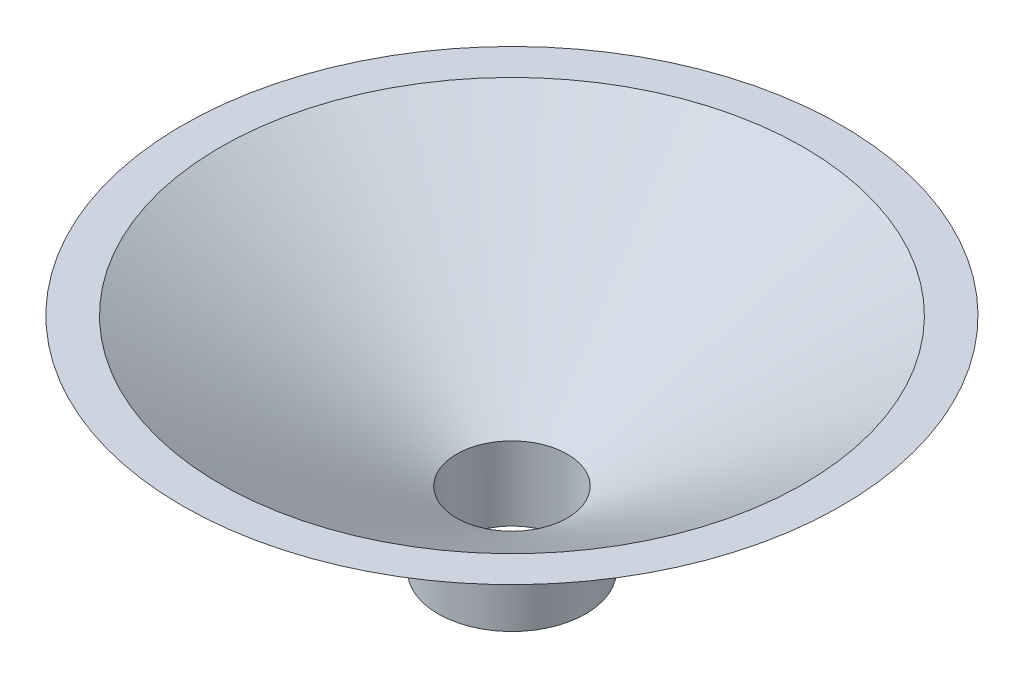
ISO-10303-21;
HEADER;
FILE_DESCRIPTION(('STEP AP214'),'2;1');
FILE_NAME('part.step','',(''),(''),'','','');
FILE_SCHEMA(('AUTOMOTIVE_DESIGN { 1 0 10303 214 1 1 1 1 }'));
ENDSEC;
DATA;
#1=APPLICATION_CONTEXT('core data for automotive mechanical design processes');
#2=APPLICATION_PROTOCOL_DEFINITION('international standard','automotive_design',2000,#1);
#3=PRODUCT_CONTEXT('',#1,'mechanical');
#4=PRODUCT('Part','Part','',(#3));
#5=PRODUCT_RELATED_PRODUCT_CATEGORY('part','',(#4));
#6=PRODUCT_DEFINITION_FORMATION('','',#4);
#7=PRODUCT_DEFINITION_CONTEXT('part definition',#1,'design');
#8=PRODUCT_DEFINITION('design','',#6,#7);
#9=PRODUCT_DEFINITION_SHAPE('','',#8);
#10=(LENGTH_UNIT() NAMED_UNIT(*) SI_UNIT(.MILLI.,.METRE.));
#11=(NAMED_UNIT(*) PLANE_ANGLE_UNIT() SI_UNIT($,.RADIAN.));
#12=(NAMED_UNIT(*) SI_UNIT($,.STERADIAN.) SOLID_ANGLE_UNIT());
#13=UNCERTAINTY_MEASURE_WITH_UNIT(LENGTH_MEASURE(1.E-05),#10,'distance_accuracy_value','');
#14=(GEOMETRIC_REPRESENTATION_CONTEXT(3) GLOBAL_UNCERTAINTY_ASSIGNED_CONTEXT((#13)) GLOBAL_UNIT_ASSIGNED_CONTEXT((#10,
#11,#12)) REPRESENTATION_CONTEXT('',''));
#15=CARTESIAN_POINT('',(0.,0.,0.));
#16=DIRECTION('',(0.,0.,1.));
#17=DIRECTION('',(1.,0.,0.));
#18=AXIS2_PLACEMENT_3D('',#15,#16,#17);
#19=CARTESIAN_POINT('',(0.,0.,0.));
#20=DIRECTION('',(0.,1.,0.));
#21=DIRECTION('',(0.,0.,1.));
#22=AXIS2_PLACEMENT_3D('',#19,#20,#21);
#23=PLANE('',#22);
#24=CARTESIAN_POINT('',(0.,0.,0.));
#25=DIRECTION('',(0.,1.,0.));
#26=DIRECTION('',(0.,0.,1.));
#27=AXIS2_PLACEMENT_3D('',#24,#25,#26);
#28=CIRCLE('',#27,10.);
#29=CARTESIAN_POINT('',(0.,0.,10.));
#30=VERTEX_POINT('',#29);
#31=EDGE_CURVE('E37',#30,#30,#28,.T.);
#32=ORIENTED_EDGE('',*,*,#31,.F.);
#33=EDGE_LOOP('',(#32));
#34=FACE_BOUND('',#33,.T.);
#35=CARTESIAN_POINT('',(0.,0.,0.));
#36=DIRECTION('',(0.,1.,0.));
#37=DIRECTION('',(0.,0.,1.));
#38=AXIS2_PLACEMENT_3D('',#35,#36,#37);
#39=CIRCLE('',#38,7.5);
#40=CARTESIAN_POINT('',(0.,0.,7.5));
#41=VERTEX_POINT('',#40);
#42=EDGE_CURVE('E44',#41,#41,#39,.T.);
#43=ORIENTED_EDGE('',*,*,#42,.T.);
#44=EDGE_LOOP('',(#43));
#45=FACE_BOUND('',#44,.T.);
#46=ADVANCED_FACE('F33',(#34,#45),#23,.F.);
#47=CARTESIAN_POINT('',(0.,10.,0.));
#48=DIRECTION('',(0.,-1.,0.));
#49=DIRECTION('',(0.,0.,-1.));
#50=AXIS2_PLACEMENT_3D('',#47,#48,#49);
#51=CYLINDRICAL_SURFACE('',#50,10.);
#52=CARTESIAN_POINT('',(0.,10.,0.));
#53=DIRECTION('',(0.,1.,0.));
#54=DIRECTION('',(0.,0.,1.));
#55=AXIS2_PLACEMENT_3D('',#52,#53,#54);
#56=CIRCLE('',#55,10.);
#57=CARTESIAN_POINT('',(0.,10.,10.));
#58=VERTEX_POINT('',#57);
#59=EDGE_CURVE('E10',#58,#58,#56,.T.);
#60=ORIENTED_EDGE('',*,*,#59,.F.);
#61=EDGE_LOOP('',(#60));
#62=FACE_BOUND('',#61,.T.);
#63=ORIENTED_EDGE('',*,*,#31,.T.);
#64=EDGE_LOOP('',(#63));
#65=FACE_BOUND('',#64,.T.);
#66=ADVANCED_FACE('F35',(#62,#65),#51,.T.);
#67=CARTESIAN_POINT('',(0.,10.,0.));
#68=DIRECTION('',(0.,-1.,0.));
#69=DIRECTION('',(0.,0.,-1.));
#70=AXIS2_PLACEMENT_3D('',#67,#68,#69);
#71=CYLINDRICAL_SURFACE('',#70,7.5);
#72=CARTESIAN_POINT('',(0.,10.,0.));
#73=DIRECTION('',(0.,-1.,0.));
#74=DIRECTION('',(0.,0.,-1.));
#75=AXIS2_PLACEMENT_3D('',#72,#73,#74);
#76=CIRCLE('',#75,7.5);
#77=CARTESIAN_POINT('',(0.,10.,-7.5));
#78=VERTEX_POINT('',#77);
#79=EDGE_CURVE('E54',#78,#78,#76,.T.);
#80=ORIENTED_EDGE('',*,*,#79,.F.);
#81=EDGE_LOOP('',(#80));
#82=FACE_BOUND('',#81,.T.);
#83=ORIENTED_EDGE('',*,*,#42,.F.);
#84=EDGE_LOOP('',(#83));
#85=FACE_BOUND('',#84,.T.);
#86=ADVANCED_FACE('F60',(#82,#85),#71,.F.);
#87=CARTESIAN_POINT('',(0.,10.,0.));
#88=DIRECTION('',(0.,1.,0.));
#89=DIRECTION('',(0.,0.,1.));
#90=AXIS2_PLACEMENT_3D('',#87,#88,#89);
#91=CONICAL_SURFACE('',#90,10.,1.0471975511966);
#92=CARTESIAN_POINT('',(0.,30.,0.));
#93=DIRECTION('',(0.,1.,0.));
#94=DIRECTION('',(0.,0.,1.));
#95=AXIS2_PLACEMENT_3D('',#92,#93,#94);
#96=CIRCLE('',#95,44.6410161513776);
#97=CARTESIAN_POINT('',(0.,30.,44.6410161513776));
#98=VERTEX_POINT('',#97);
#99=EDGE_CURVE('E48',#98,#98,#96,.T.);
#100=ORIENTED_EDGE('',*,*,#99,.F.);
#101=EDGE_LOOP('',(#100));
#102=FACE_BOUND('',#101,.T.);
#103=ORIENTED_EDGE('',*,*,#59,.T.);
#104=EDGE_LOOP('',(#103));
#105=FACE_BOUND('',#104,.T.);
#106=ADVANCED_FACE('F63',(#102,#105),#91,.T.);
#107=CARTESIAN_POINT('',(0.,30.,0.));
#108=DIRECTION('',(0.,1.,0.));
#109=DIRECTION('',(0.,0.,1.));
#110=AXIS2_PLACEMENT_3D('',#107,#108,#109);
#111=PLANE('',#110);
#112=CARTESIAN_POINT('',(0.,30.,0.));
#113=DIRECTION('',(0.,-1.,0.));
#114=DIRECTION('',(0.,0.,-1.));
#115=AXIS2_PLACEMENT_3D('',#112,#113,#114);
#116=CIRCLE('',#115,39.5066905808211);
#117=CARTESIAN_POINT('',(0.,30.,-39.5066905808211));
#118=VERTEX_POINT('',#117);
#119=EDGE_CURVE('E51',#118,#118,#116,.T.);
#120=ORIENTED_EDGE('',*,*,#119,.T.);
#121=EDGE_LOOP('',(#120));
#122=FACE_BOUND('',#121,.T.);
#123=ORIENTED_EDGE('',*,*,#99,.T.);
#124=EDGE_LOOP('',(#123));
#125=FACE_BOUND('',#124,.T.);
#126=ADVANCED_FACE('F77',(#122,#125),#111,.T.);
#127=CARTESIAN_POINT('',(0.,10.,0.));
#128=DIRECTION('',(0.,1.,0.));
#129=DIRECTION('',(0.,0.,-1.));
#130=AXIS2_PLACEMENT_3D('',#127,#128,#129);
#131=CONICAL_SURFACE('',#130,7.5,1.01229096615671);
#132=ORIENTED_EDGE('',*,*,#119,.F.);
#133=EDGE_LOOP('',(#132));
#134=FACE_BOUND('',#133,.T.);
#135=ORIENTED_EDGE('',*,*,#79,.T.);
#136=EDGE_LOOP('',(#135));
#137=FACE_BOUND('',#136,.T.);
#138=ADVANCED_FACE('F58',(#134,#137),#131,.F.);
#139=CLOSED_SHELL('',(#46,#66,#86,#106,#126,#138));
#140=MANIFOLD_SOLID_BREP('B2',#139);
#141=ADVANCED_BREP_SHAPE_REPRESENTATION('',(#18,#140),#14);
#142=SHAPE_DEFINITION_REPRESENTATION(#9,#141);
ENDSEC;
END-ISO-10303-21;
